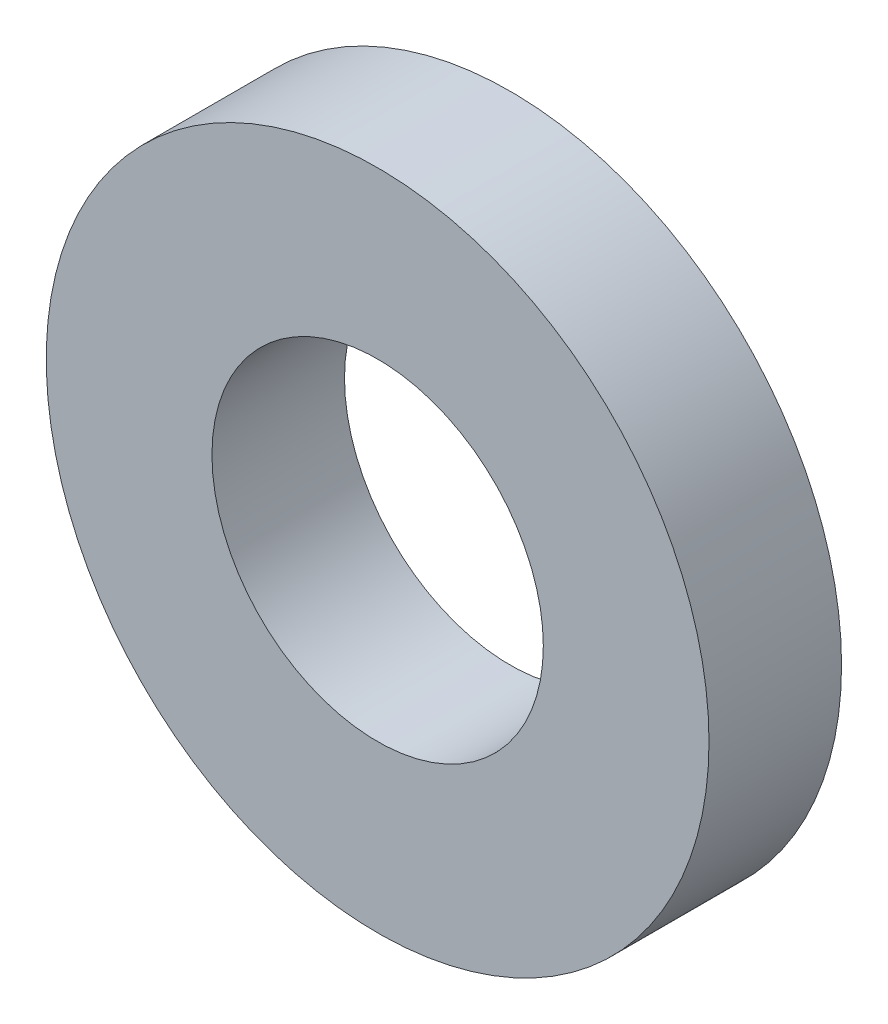
ISO-10303-21;
HEADER;
FILE_DESCRIPTION(('STEP AP214'),'2;1');
FILE_NAME('part.step','',(''),(''),'','','');
FILE_SCHEMA(('AUTOMOTIVE_DESIGN { 1 0 10303 214 1 1 1 1 }'));
ENDSEC;
DATA;
#1=APPLICATION_CONTEXT('core data for automotive mechanical design processes');
#2=APPLICATION_PROTOCOL_DEFINITION('international standard','automotive_design',2000,#1);
#3=PRODUCT_CONTEXT('',#1,'mechanical');
#4=PRODUCT('Part','Part','',(#3));
#5=PRODUCT_RELATED_PRODUCT_CATEGORY('part','',(#4));
#6=PRODUCT_DEFINITION_FORMATION('','',#4);
#7=PRODUCT_DEFINITION_CONTEXT('part definition',#1,'design');
#8=PRODUCT_DEFINITION('design','',#6,#7);
#9=PRODUCT_DEFINITION_SHAPE('','',#8);
#10=(LENGTH_UNIT() NAMED_UNIT(*) SI_UNIT(.MILLI.,.METRE.));
#11=(NAMED_UNIT(*) PLANE_ANGLE_UNIT() SI_UNIT($,.RADIAN.));
#12=(NAMED_UNIT(*) SI_UNIT($,.STERADIAN.) SOLID_ANGLE_UNIT());
#13=UNCERTAINTY_MEASURE_WITH_UNIT(LENGTH_MEASURE(1.E-05),#10,'distance_accuracy_value','');
#14=(GEOMETRIC_REPRESENTATION_CONTEXT(3) GLOBAL_UNCERTAINTY_ASSIGNED_CONTEXT((#13)) GLOBAL_UNIT_ASSIGNED_CONTEXT((#10,
#11,#12)) REPRESENTATION_CONTEXT('',''));
#15=CARTESIAN_POINT('',(0.,0.,0.));
#16=DIRECTION('',(0.,0.,1.));
#17=DIRECTION('',(1.,0.,0.));
#18=AXIS2_PLACEMENT_3D('',#15,#16,#17);
#19=CARTESIAN_POINT('',(0.,0.,2.54));
#20=DIRECTION('',(0.,0.,1.));
#21=DIRECTION('',(1.,0.,0.));
#22=AXIS2_PLACEMENT_3D('',#19,#20,#21);
#23=PLANE('',#22);
#24=CARTESIAN_POINT('',(0.,0.,2.54));
#25=DIRECTION('',(0.,0.,1.));
#26=DIRECTION('',(1.,0.,0.));
#27=AXIS2_PLACEMENT_3D('',#24,#25,#26);
#28=CIRCLE('',#27,6.35);
#29=CARTESIAN_POINT('',(6.35,0.,2.54));
#30=VERTEX_POINT('',#29);
#31=EDGE_CURVE('E10',#30,#30,#28,.T.);
#32=ORIENTED_EDGE('',*,*,#31,.T.);
#33=EDGE_LOOP('',(#32));
#34=FACE_BOUND('',#33,.T.);
#35=CARTESIAN_POINT('',(0.,0.,2.54));
#36=DIRECTION('',(0.,0.,1.));
#37=DIRECTION('',(1.,0.,0.));
#38=AXIS2_PLACEMENT_3D('',#35,#36,#37);
#39=CIRCLE('',#38,3.175);
#40=CARTESIAN_POINT('',(3.175,0.,2.54));
#41=VERTEX_POINT('',#40);
#42=EDGE_CURVE('E46',#41,#41,#39,.T.);
#43=ORIENTED_EDGE('',*,*,#42,.F.);
#44=EDGE_LOOP('',(#43));
#45=FACE_BOUND('',#44,.T.);
#46=ADVANCED_FACE('F35',(#34,#45),#23,.T.);
#47=CARTESIAN_POINT('',(0.,0.,0.));
#48=DIRECTION('',(0.,0.,1.));
#49=DIRECTION('',(1.,0.,0.));
#50=AXIS2_PLACEMENT_3D('',#47,#48,#49);
#51=PLANE('',#50);
#52=CARTESIAN_POINT('',(0.,0.,0.));
#53=DIRECTION('',(0.,0.,1.));
#54=DIRECTION('',(1.,0.,0.));
#55=AXIS2_PLACEMENT_3D('',#52,#53,#54);
#56=CIRCLE('',#55,6.35);
#57=CARTESIAN_POINT('',(6.35,0.,0.));
#58=VERTEX_POINT('',#57);
#59=EDGE_CURVE('E39',#58,#58,#56,.T.);
#60=ORIENTED_EDGE('',*,*,#59,.F.);
#61=EDGE_LOOP('',(#60));
#62=FACE_BOUND('',#61,.T.);
#63=CARTESIAN_POINT('',(0.,0.,0.));
#64=DIRECTION('',(0.,0.,1.));
#65=DIRECTION('',(1.,0.,0.));
#66=AXIS2_PLACEMENT_3D('',#63,#64,#65);
#67=CIRCLE('',#66,3.175);
#68=CARTESIAN_POINT('',(3.175,0.,0.));
#69=VERTEX_POINT('',#68);
#70=EDGE_CURVE('E48',#69,#69,#67,.T.);
#71=ORIENTED_EDGE('',*,*,#70,.T.);
#72=EDGE_LOOP('',(#71));
#73=FACE_BOUND('',#72,.T.);
#74=ADVANCED_FACE('F58',(#62,#73),#51,.F.);
#75=CARTESIAN_POINT('',(0.,0.,2.54));
#76=DIRECTION('',(0.,0.,-1.));
#77=DIRECTION('',(-1.,0.,0.));
#78=AXIS2_PLACEMENT_3D('',#75,#76,#77);
#79=CYLINDRICAL_SURFACE('',#78,6.35);
#80=ORIENTED_EDGE('',*,*,#31,.F.);
#81=EDGE_LOOP('',(#80));
#82=FACE_BOUND('',#81,.T.);
#83=ORIENTED_EDGE('',*,*,#59,.T.);
#84=EDGE_LOOP('',(#83));
#85=FACE_BOUND('',#84,.T.);
#86=ADVANCED_FACE('F37',(#82,#85),#79,.T.);
#87=CARTESIAN_POINT('',(0.,0.,2.54));
#88=DIRECTION('',(0.,0.,-1.));
#89=DIRECTION('',(-1.,0.,0.));
#90=AXIS2_PLACEMENT_3D('',#87,#88,#89);
#91=CYLINDRICAL_SURFACE('',#90,3.175);
#92=ORIENTED_EDGE('',*,*,#42,.T.);
#93=EDGE_LOOP('',(#92));
#94=FACE_BOUND('',#93,.T.);
#95=ORIENTED_EDGE('',*,*,#70,.F.);
#96=EDGE_LOOP('',(#95));
#97=FACE_BOUND('',#96,.T.);
#98=ADVANCED_FACE('F54',(#94,#97),#91,.F.);
#99=CLOSED_SHELL('',(#46,#74,#86,#98));
#100=MANIFOLD_SOLID_BREP('B2',#99);
#101=ADVANCED_BREP_SHAPE_REPRESENTATION('',(#18,#100),#14);
#102=SHAPE_DEFINITION_REPRESENTATION(#9,#101);
ENDSEC;
END-ISO-10303-21;
